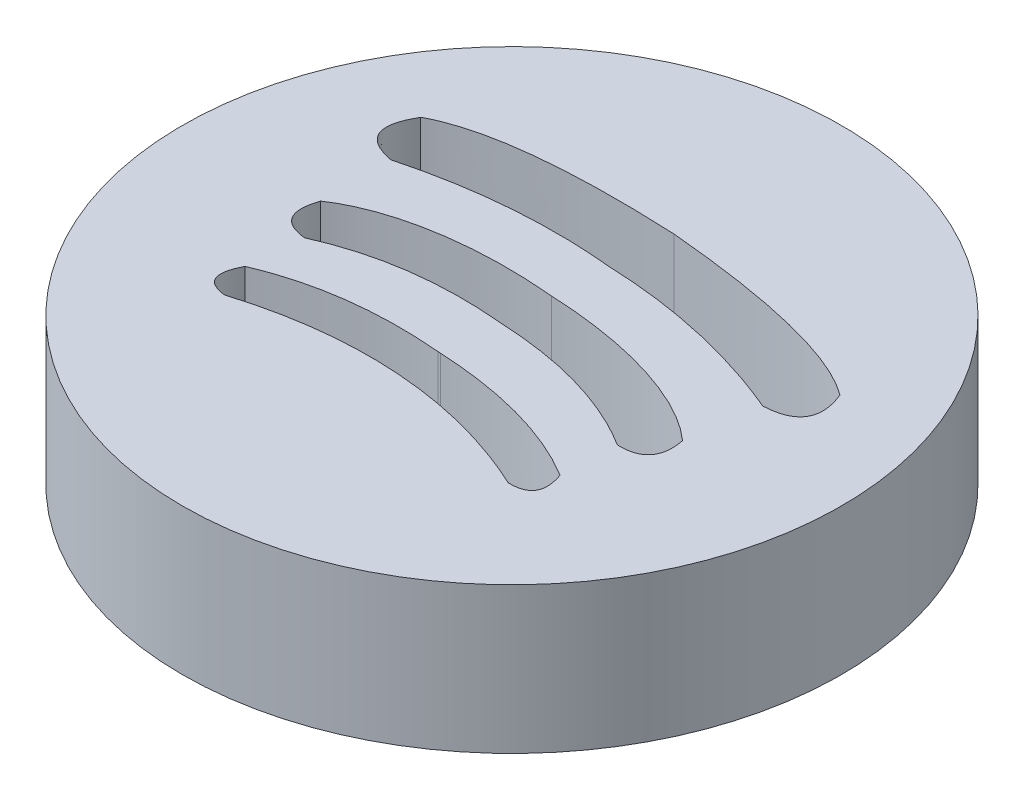
ISO-10303-21;
HEADER;
FILE_DESCRIPTION(('STEP AP214'),'2;1');
FILE_NAME('part.step','',(''),(''),'','','');
FILE_SCHEMA(('AUTOMOTIVE_DESIGN { 1 0 10303 214 1 1 1 1 }'));
ENDSEC;
DATA;
#1=APPLICATION_CONTEXT('core data for automotive mechanical design processes');
#2=APPLICATION_PROTOCOL_DEFINITION('international standard','automotive_design',2000,#1);
#3=PRODUCT_CONTEXT('',#1,'mechanical');
#4=PRODUCT('Part','Part','',(#3));
#5=PRODUCT_RELATED_PRODUCT_CATEGORY('part','',(#4));
#6=PRODUCT_DEFINITION_FORMATION('','',#4);
#7=PRODUCT_DEFINITION_CONTEXT('part definition',#1,'design');
#8=PRODUCT_DEFINITION('design','',#6,#7);
#9=PRODUCT_DEFINITION_SHAPE('','',#8);
#10=(LENGTH_UNIT() NAMED_UNIT(*) SI_UNIT(.MILLI.,.METRE.));
#11=(NAMED_UNIT(*) PLANE_ANGLE_UNIT() SI_UNIT($,.RADIAN.));
#12=(NAMED_UNIT(*) SI_UNIT($,.STERADIAN.) SOLID_ANGLE_UNIT());
#13=UNCERTAINTY_MEASURE_WITH_UNIT(LENGTH_MEASURE(1.E-05),#10,'distance_accuracy_value','');
#14=(GEOMETRIC_REPRESENTATION_CONTEXT(3) GLOBAL_UNCERTAINTY_ASSIGNED_CONTEXT((#13)) GLOBAL_UNIT_ASSIGNED_CONTEXT((#10,
#11,#12)) REPRESENTATION_CONTEXT('',''));
#15=CARTESIAN_POINT('',(0.,0.,0.));
#16=DIRECTION('',(0.,0.,1.));
#17=DIRECTION('',(1.,0.,0.));
#18=AXIS2_PLACEMENT_3D('',#15,#16,#17);
#19=CARTESIAN_POINT('',(4.84725779247813,2.,-4.63541451285348));
#20=DIRECTION('',(0.,1.,0.));
#21=DIRECTION('',(0.,0.,1.));
#22=AXIS2_PLACEMENT_3D('',#19,#20,#21);
#23=PLANE('',#22);
#24=CARTESIAN_POINT('',(4.84725779247813,2.,-4.63541451285348));
#25=DIRECTION('',(0.,1.,0.));
#26=DIRECTION('',(0.,0.,1.));
#27=AXIS2_PLACEMENT_3D('',#24,#25,#26);
#28=CIRCLE('',#27,4.51083216624037);
#29=CARTESIAN_POINT('',(4.84725779247813,2.,-0.124582346613107));
#30=VERTEX_POINT('',#29);
#31=EDGE_CURVE('E11',#30,#30,#28,.T.);
#32=ORIENTED_EDGE('',*,*,#31,.T.);
#33=EDGE_LOOP('',(#32));
#34=FACE_BOUND('',#33,.T.);
#35=CARTESIAN_POINT('',(4.98940546980019,2.,-6.7126165823093));
#36=CARTESIAN_POINT('',(2.70847393254779,2.,-6.81932821464787));
#37=CARTESIAN_POINT('',(1.87003943403578,2.,-6.3624125413338));
#38=B_SPLINE_CURVE_WITH_KNOTS('',2,(#35,#36,#37),.UNSPECIFIED.,.F.,.F.,(3,3),(0.,1.),.UNSPECIFIED.);
#39=CARTESIAN_POINT('',(4.98940546980019,2.,-6.7126165823093));
#40=VERTEX_POINT('',#39);
#41=CARTESIAN_POINT('',(1.87003943403578,2.,-6.3624125413338));
#42=VERTEX_POINT('',#41);
#43=EDGE_CURVE('E316',#40,#42,#38,.T.);
#44=ORIENTED_EDGE('',*,*,#43,.F.);
#45=CARTESIAN_POINT('',(8.03198473306715,2.,-5.94073656434407));
#46=CARTESIAN_POINT('',(7.26361044764534,2.,-6.50760982911996));
#47=CARTESIAN_POINT('',(4.98940546980019,2.,-6.7126165823093));
#48=B_SPLINE_CURVE_WITH_KNOTS('',2,(#45,#46,#47),.UNSPECIFIED.,.F.,.F.,(3,3),(0.,1.),.UNSPECIFIED.);
#49=CARTESIAN_POINT('',(8.03198473306715,2.,-5.94073656434407));
#50=VERTEX_POINT('',#49);
#51=EDGE_CURVE('E311',#50,#40,#48,.T.);
#52=ORIENTED_EDGE('',*,*,#51,.F.);
#53=CARTESIAN_POINT('',(7.63590095297284,2.,-5.28073428955623));
#54=CARTESIAN_POINT('',(8.28916295083527,2.,-5.3130360702294));
#55=CARTESIAN_POINT('',(8.03198473306715,2.,-5.94073656434407));
#56=B_SPLINE_CURVE_WITH_KNOTS('',2,(#53,#54,#55),.UNSPECIFIED.,.F.,.F.,(3,3),(0.,1.),.UNSPECIFIED.);
#57=CARTESIAN_POINT('',(7.63590095297284,2.,-5.28073428955623));
#58=VERTEX_POINT('',#57);
#59=EDGE_CURVE('E442',#58,#50,#56,.T.);
#60=ORIENTED_EDGE('',*,*,#59,.F.);
#61=CARTESIAN_POINT('',(4.93259630959555,2.,-5.88246509925867));
#62=CARTESIAN_POINT('',(6.33169602290301,2.,-5.83002968698095));
#63=CARTESIAN_POINT('',(7.63590095297284,2.,-5.28073428955623));
#64=B_SPLINE_CURVE_WITH_KNOTS('',2,(#61,#62,#63),.UNSPECIFIED.,.F.,.F.,(3,3),(0.,1.),.UNSPECIFIED.);
#65=CARTESIAN_POINT('',(4.93259630959555,2.,-5.88246509925867));
#66=VERTEX_POINT('',#65);
#67=EDGE_CURVE('E448',#66,#58,#64,.T.);
#68=ORIENTED_EDGE('',*,*,#67,.F.);
#69=CARTESIAN_POINT('',(2.17252092561603,2.,-5.65460585103602));
#70=CARTESIAN_POINT('',(3.53939632227504,2.,-6.02111312689651));
#71=CARTESIAN_POINT('',(4.93259630959555,2.,-5.88246509925867));
#72=B_SPLINE_CURVE_WITH_KNOTS('',2,(#69,#70,#71),.UNSPECIFIED.,.F.,.F.,(3,3),(0.,1.),.UNSPECIFIED.);
#73=CARTESIAN_POINT('',(2.17252092561603,2.,-5.65460585103602));
#74=VERTEX_POINT('',#73);
#75=EDGE_CURVE('E524',#74,#66,#72,.T.);
#76=ORIENTED_EDGE('',*,*,#75,.F.);
#77=CARTESIAN_POINT('',(1.87003943403578,2.,-6.3624125413338));
#78=CARTESIAN_POINT('',(1.52974919326217,2.,-5.77559817712616));
#79=CARTESIAN_POINT('',(2.17252092561603,2.,-5.65460585103602));
#80=B_SPLINE_CURVE_WITH_KNOTS('',2,(#77,#78,#79),.UNSPECIFIED.,.F.,.F.,(3,3),(0.,1.),.UNSPECIFIED.);
#81=EDGE_CURVE('E523',#42,#74,#80,.T.);
#82=ORIENTED_EDGE('',*,*,#81,.F.);
#83=EDGE_LOOP('',(#44,#52,#60,#68,#76,#82));
#84=FACE_BOUND('',#83,.T.);
#85=CARTESIAN_POINT('',(4.88179042083362,2.,-5.14003933990051));
#86=CARTESIAN_POINT('',(3.62730607239337,2.,-5.25627963586896));
#87=CARTESIAN_POINT('',(2.68965651797037,2.,-5.0306545584499));
#88=CARTESIAN_POINT('',(2.18009286438089,2.,-4.68551879994203));
#89=B_SPLINE_CURVE_WITH_KNOTS('',3,(#85,#86,#87,#88),.UNSPECIFIED.,.F.,.F.,(4,4),(0.,1.),.UNSPECIFIED.);
#90=CARTESIAN_POINT('',(4.88179042083362,2.,-5.14003933990051));
#91=VERTEX_POINT('',#90);
#92=CARTESIAN_POINT('',(2.18009286438089,2.,-4.68551879994203));
#93=VERTEX_POINT('',#92);
#94=EDGE_CURVE('E418',#91,#93,#89,.T.);
#95=ORIENTED_EDGE('',*,*,#94,.F.);
#96=CARTESIAN_POINT('',(7.4963841511337,2.,-4.32171285660529));
#97=CARTESIAN_POINT('',(7.03858747883807,2.,-4.73304728951276));
#98=CARTESIAN_POINT('',(6.14041511433174,2.,-5.08430184977799));
#99=CARTESIAN_POINT('',(4.88179042083362,2.,-5.14003933990051));
#100=B_SPLINE_CURVE_WITH_KNOTS('',3,(#96,#97,#98,#99),.UNSPECIFIED.,.F.,.F.,(4,4),(0.,1.),.UNSPECIFIED.);
#101=CARTESIAN_POINT('',(7.4963841511337,2.,-4.32171285660529));
#102=VERTEX_POINT('',#101);
#103=EDGE_CURVE('E291',#102,#91,#100,.T.);
#104=ORIENTED_EDGE('',*,*,#103,.F.);
#105=CARTESIAN_POINT('',(7.10196280452291,2.,-3.82417094775993));
#106=CARTESIAN_POINT('',(7.596066746737,2.,-3.80965362464692));
#107=CARTESIAN_POINT('',(7.4963841511337,2.,-4.32171285660529));
#108=B_SPLINE_CURVE_WITH_KNOTS('',2,(#105,#106,#107),.UNSPECIFIED.,.F.,.F.,(3,3),(0.,1.),.UNSPECIFIED.);
#109=CARTESIAN_POINT('',(7.10196280452291,2.,-3.82417094775993));
#110=VERTEX_POINT('',#109);
#111=EDGE_CURVE('E230',#110,#102,#108,.T.);
#112=ORIENTED_EDGE('',*,*,#111,.F.);
#113=CARTESIAN_POINT('',(4.83922212443066,2.,-4.4730324025778));
#114=CARTESIAN_POINT('',(6.15790572347401,2.,-4.41569467157149));
#115=CARTESIAN_POINT('',(7.10196280452291,2.,-3.82417094775993));
#116=B_SPLINE_CURVE_WITH_KNOTS('',2,(#113,#114,#115),.UNSPECIFIED.,.F.,.F.,(3,3),(0.,1.),.UNSPECIFIED.);
#117=CARTESIAN_POINT('',(4.83922212443066,2.,-4.4730324025778));
#118=VERTEX_POINT('',#117);
#119=EDGE_CURVE('E236',#118,#110,#116,.T.);
#120=ORIENTED_EDGE('',*,*,#119,.F.);
#121=DIRECTION('',(0.997666703296272,0.,0.0682726089581153));
#122=VECTOR('',#121,1.);
#123=CARTESIAN_POINT('',(4.8330977840206,2.,-4.47345150516643));
#124=LINE('',#123,#122);
#125=CARTESIAN_POINT('',(4.8330977840206,2.,-4.47345150516643));
#126=VERTEX_POINT('',#125);
#127=EDGE_CURVE('E771',#126,#118,#124,.T.);
#128=ORIENTED_EDGE('',*,*,#127,.F.);
#129=CARTESIAN_POINT('',(2.50305884629386,2.,-4.13888443928882));
#130=CARTESIAN_POINT('',(3.51889642166361,2.,-4.59628809972166));
#131=CARTESIAN_POINT('',(4.8330977840206,2.,-4.47345150516643));
#132=B_SPLINE_CURVE_WITH_KNOTS('',2,(#129,#130,#131),.UNSPECIFIED.,.F.,.F.,(3,3),(0.,1.),.UNSPECIFIED.);
#133=CARTESIAN_POINT('',(2.50305884629386,2.,-4.13888443928882));
#134=VERTEX_POINT('',#133);
#135=EDGE_CURVE('E773',#134,#126,#132,.T.);
#136=ORIENTED_EDGE('',*,*,#135,.F.);
#137=CARTESIAN_POINT('',(2.18009286438089,2.,-4.68551879994203));
#138=CARTESIAN_POINT('',(2.01158344258292,2.,-4.19181255968846));
#139=CARTESIAN_POINT('',(2.50305884629386,2.,-4.13888443928882));
#140=B_SPLINE_CURVE_WITH_KNOTS('',2,(#137,#138,#139),.UNSPECIFIED.,.F.,.F.,(3,3),(0.,1.),.UNSPECIFIED.);
#141=EDGE_CURVE('E774',#93,#134,#140,.T.);
#142=ORIENTED_EDGE('',*,*,#141,.F.);
#143=EDGE_LOOP('',(#95,#104,#112,#120,#128,#136,#142));
#144=FACE_BOUND('',#143,.T.);
#145=CARTESIAN_POINT('',(2.43553461977165,2.,-3.39217956801337));
#146=CARTESIAN_POINT('',(2.21176454515322,2.,-2.95962393907315));
#147=CARTESIAN_POINT('',(2.63517240421462,2.,-2.91425881131657));
#148=B_SPLINE_CURVE_WITH_KNOTS('',2,(#145,#146,#147),.UNSPECIFIED.,.F.,.F.,(3,3),(0.,1.),.UNSPECIFIED.);
#149=CARTESIAN_POINT('',(2.43553461977165,2.,-3.39217956801337));
#150=VERTEX_POINT('',#149);
#151=CARTESIAN_POINT('',(2.63517240421462,2.,-2.91425881131657));
#152=VERTEX_POINT('',#151);
#153=EDGE_CURVE('E184',#150,#152,#148,.T.);
#154=ORIENTED_EDGE('',*,*,#153,.F.);
#155=CARTESIAN_POINT('',(4.76583999310397,2.,-3.70415294578224));
#156=CARTESIAN_POINT('',(3.42982471425161,2.,-3.82067361564292));
#157=CARTESIAN_POINT('',(2.43553461977165,2.,-3.39217956801337));
#158=B_SPLINE_CURVE_WITH_KNOTS('',2,(#155,#156,#157),.UNSPECIFIED.,.F.,.F.,(3,3),(0.,1.),.UNSPECIFIED.);
#159=CARTESIAN_POINT('',(4.76583999310397,2.,-3.70415294578224));
#160=VERTEX_POINT('',#159);
#161=EDGE_CURVE('E176',#160,#150,#158,.T.);
#162=ORIENTED_EDGE('',*,*,#161,.F.);
#163=DIRECTION('',(-0.997666703296267,0.,-0.0682726089581976));
#164=VECTOR('',#163,1.);
#165=CARTESIAN_POINT('',(4.76583999310397,2.,-3.70415294578224));
#166=LINE('',#165,#164);
#167=CARTESIAN_POINT('',(4.80105397763659,2.,-3.70174317247026));
#168=VERTEX_POINT('',#167);
#169=EDGE_CURVE('E359',#168,#160,#166,.T.);
#170=ORIENTED_EDGE('',*,*,#169,.F.);
#171=CARTESIAN_POINT('',(7.06713647124811,2.,-3.0752284850403));
#172=CARTESIAN_POINT('',(6.14048774028241,2.,-3.63517675964662));
#173=CARTESIAN_POINT('',(4.8010539776366,2.,-3.70174317247026));
#174=B_SPLINE_CURVE_WITH_KNOTS('',2,(#171,#172,#173),.UNSPECIFIED.,.F.,.F.,(3,3),(0.,1.),.UNSPECIFIED.);
#175=CARTESIAN_POINT('',(7.06713647124811,2.,-3.0752284850403));
#176=VERTEX_POINT('',#175);
#177=EDGE_CURVE('E728',#176,#168,#174,.T.);
#178=ORIENTED_EDGE('',*,*,#177,.F.);
#179=CARTESIAN_POINT('',(6.80425424170266,2.,-2.62895902826766));
#180=CARTESIAN_POINT('',(7.22989490431553,2.,-2.61622182834778));
#181=CARTESIAN_POINT('',(7.06713647124811,2.,-3.0752284850403));
#182=B_SPLINE_CURVE_WITH_KNOTS('',2,(#179,#180,#181),.UNSPECIFIED.,.F.,.F.,(3,3),(0.,1.),.UNSPECIFIED.);
#183=CARTESIAN_POINT('',(6.80425424170266,2.,-2.62895902826766));
#184=VERTEX_POINT('',#183);
#185=EDGE_CURVE('E732',#184,#176,#182,.T.);
#186=ORIENTED_EDGE('',*,*,#185,.F.);
#187=CARTESIAN_POINT('',(4.77441326033121,2.,-3.16339640780165));
#188=CARTESIAN_POINT('',(5.80955430026965,2.,-3.09103181208245));
#189=CARTESIAN_POINT('',(6.80425424170266,2.,-2.62895902826766));
#190=B_SPLINE_CURVE_WITH_KNOTS('',2,(#187,#188,#189),.UNSPECIFIED.,.F.,.F.,(3,3),(0.,1.),.UNSPECIFIED.);
#191=CARTESIAN_POINT('',(4.77441326033121,2.,-3.16339640780165));
#192=VERTEX_POINT('',#191);
#193=EDGE_CURVE('E740',#192,#184,#190,.T.);
#194=ORIENTED_EDGE('',*,*,#193,.F.);
#195=DIRECTION('',(0.997666703296266,0.,0.0682726089582034));
#196=VECTOR('',#195,1.);
#197=CARTESIAN_POINT('',(4.7188951989524,2.,-3.16719563542157));
#198=LINE('',#197,#196);
#199=CARTESIAN_POINT('',(4.7188951989524,2.,-3.16719563542157));
#200=VERTEX_POINT('',#199);
#201=EDGE_CURVE('E199',#200,#192,#198,.T.);
#202=ORIENTED_EDGE('',*,*,#201,.F.);
#203=CARTESIAN_POINT('',(2.63517240421462,2.,-2.91425881131657));
#204=CARTESIAN_POINT('',(3.68354606844259,2.,-3.23651940646029));
#205=CARTESIAN_POINT('',(4.7188951989524,2.,-3.16719563542157));
#206=B_SPLINE_CURVE_WITH_KNOTS('',2,(#203,#204,#205),.UNSPECIFIED.,.F.,.F.,(3,3),(0.,1.),.UNSPECIFIED.);
#207=EDGE_CURVE('E197',#152,#200,#206,.T.);
#208=ORIENTED_EDGE('',*,*,#207,.F.);
#209=EDGE_LOOP('',(#154,#162,#170,#178,#186,#194,#202,#208));
#210=FACE_BOUND('',#209,.T.);
#211=ADVANCED_FACE('F33',(#34,#84,#144,#210),#23,.T.);
#212=CARTESIAN_POINT('',(4.84725779247813,0.,-4.63541451285348));
#213=DIRECTION('',(0.,1.,0.));
#214=DIRECTION('',(0.,0.,1.));
#215=AXIS2_PLACEMENT_3D('',#212,#213,#214);
#216=PLANE('',#215);
#217=CARTESIAN_POINT('',(7.4963841511337,0.,-4.32171285660529));
#218=CARTESIAN_POINT('',(7.03858747883807,0.,-4.73304728951276));
#219=CARTESIAN_POINT('',(6.14041511433174,0.,-5.08430184977799));
#220=CARTESIAN_POINT('',(4.88179042083362,0.,-5.14003933990051));
#221=B_SPLINE_CURVE_WITH_KNOTS('',3,(#217,#218,#219,#220),.UNSPECIFIED.,.F.,.F.,(4,4),(0.,1.),.UNSPECIFIED.);
#222=CARTESIAN_POINT('',(7.4963841511337,0.,-4.32171285660529));
#223=VERTEX_POINT('',#222);
#224=CARTESIAN_POINT('',(4.88179042083362,0.,-5.14003933990051));
#225=VERTEX_POINT('',#224);
#226=EDGE_CURVE('E192',#223,#225,#221,.T.);
#227=ORIENTED_EDGE('',*,*,#226,.T.);
#228=CARTESIAN_POINT('',(4.88179042083362,0.,-5.14003933990051));
#229=CARTESIAN_POINT('',(3.62730607239337,0.,-5.25627963586896));
#230=CARTESIAN_POINT('',(2.68965651797037,0.,-5.0306545584499));
#231=CARTESIAN_POINT('',(2.18009286438089,0.,-4.68551879994203));
#232=B_SPLINE_CURVE_WITH_KNOTS('',3,(#228,#229,#230,#231),.UNSPECIFIED.,.F.,.F.,(4,4),(0.,1.),.UNSPECIFIED.);
#233=CARTESIAN_POINT('',(2.18009286438089,0.,-4.68551879994203));
#234=VERTEX_POINT('',#233);
#235=EDGE_CURVE('E248',#225,#234,#232,.T.);
#236=ORIENTED_EDGE('',*,*,#235,.T.);
#237=CARTESIAN_POINT('',(2.18009286438089,0.,-4.68551879994203));
#238=CARTESIAN_POINT('',(2.01158344258292,0.,-4.19181255968846));
#239=CARTESIAN_POINT('',(2.50305884629386,0.,-4.13888443928882));
#240=B_SPLINE_CURVE_WITH_KNOTS('',2,(#237,#238,#239),.UNSPECIFIED.,.F.,.F.,(3,3),(0.,1.),.UNSPECIFIED.);
#241=CARTESIAN_POINT('',(2.50305884629386,0.,-4.13888443928882));
#242=VERTEX_POINT('',#241);
#243=EDGE_CURVE('E256',#234,#242,#240,.T.);
#244=ORIENTED_EDGE('',*,*,#243,.T.);
#245=CARTESIAN_POINT('',(2.50305884629386,0.,-4.13888443928882));
#246=CARTESIAN_POINT('',(3.51889642166361,0.,-4.59628809972166));
#247=CARTESIAN_POINT('',(4.8330977840206,0.,-4.47345150516643));
#248=B_SPLINE_CURVE_WITH_KNOTS('',2,(#245,#246,#247),.UNSPECIFIED.,.F.,.F.,(3,3),(0.,1.),.UNSPECIFIED.);
#249=CARTESIAN_POINT('',(4.8330977840206,0.,-4.47345150516643));
#250=VERTEX_POINT('',#249);
#251=EDGE_CURVE('E264',#242,#250,#248,.T.);
#252=ORIENTED_EDGE('',*,*,#251,.T.);
#253=DIRECTION('',(0.997666703296272,0.,0.0682726089581153));
#254=VECTOR('',#253,1.);
#255=CARTESIAN_POINT('',(4.8330977840206,0.,-4.47345150516643));
#256=LINE('',#255,#254);
#257=CARTESIAN_POINT('',(4.83922212443066,0.,-4.4730324025778));
#258=VERTEX_POINT('',#257);
#259=EDGE_CURVE('E272',#250,#258,#256,.T.);
#260=ORIENTED_EDGE('',*,*,#259,.T.);
#261=CARTESIAN_POINT('',(4.83922212443066,0.,-4.4730324025778));
#262=CARTESIAN_POINT('',(6.15790572347401,0.,-4.41569467157149));
#263=CARTESIAN_POINT('',(7.10196280452291,0.,-3.82417094775993));
#264=B_SPLINE_CURVE_WITH_KNOTS('',2,(#261,#262,#263),.UNSPECIFIED.,.F.,.F.,(3,3),(0.,1.),.UNSPECIFIED.);
#265=CARTESIAN_POINT('',(7.10196280452291,0.,-3.82417094775993));
#266=VERTEX_POINT('',#265);
#267=EDGE_CURVE('E278',#258,#266,#264,.T.);
#268=ORIENTED_EDGE('',*,*,#267,.T.);
#269=CARTESIAN_POINT('',(7.10196280452291,0.,-3.82417094775993));
#270=CARTESIAN_POINT('',(7.596066746737,0.,-3.80965362464692));
#271=CARTESIAN_POINT('',(7.4963841511337,0.,-4.32171285660529));
#272=B_SPLINE_CURVE_WITH_KNOTS('',2,(#269,#270,#271),.UNSPECIFIED.,.F.,.F.,(3,3),(0.,1.),.UNSPECIFIED.);
#273=EDGE_CURVE('E283',#266,#223,#272,.T.);
#274=ORIENTED_EDGE('',*,*,#273,.T.);
#275=EDGE_LOOP('',(#227,#236,#244,#252,#260,#268,#274));
#276=FACE_BOUND('',#275,.T.);
#277=CARTESIAN_POINT('',(4.84725779247813,0.,-4.63541451285348));
#278=DIRECTION('',(0.,1.,0.));
#279=DIRECTION('',(0.,0.,1.));
#280=AXIS2_PLACEMENT_3D('',#277,#278,#279);
#281=CIRCLE('',#280,4.51083216624037);
#282=CARTESIAN_POINT('',(4.84725779247813,0.,-0.124582346613107));
#283=VERTEX_POINT('',#282);
#284=EDGE_CURVE('E37',#283,#283,#281,.T.);
#285=ORIENTED_EDGE('',*,*,#284,.F.);
#286=EDGE_LOOP('',(#285));
#287=FACE_BOUND('',#286,.T.);
#288=CARTESIAN_POINT('',(8.03198473306715,0.,-5.94073656434407));
#289=CARTESIAN_POINT('',(7.26361044764534,0.,-6.50760982911996));
#290=CARTESIAN_POINT('',(4.98940546980019,0.,-6.7126165823093));
#291=B_SPLINE_CURVE_WITH_KNOTS('',2,(#288,#289,#290),.UNSPECIFIED.,.F.,.F.,(3,3),(0.,1.),.UNSPECIFIED.);
#292=CARTESIAN_POINT('',(8.03198473306715,0.,-5.94073656434407));
#293=VERTEX_POINT('',#292);
#294=CARTESIAN_POINT('',(4.98940546980019,0.,-6.7126165823093));
#295=VERTEX_POINT('',#294);
#296=EDGE_CURVE('E310',#293,#295,#291,.T.);
#297=ORIENTED_EDGE('',*,*,#296,.T.);
#298=CARTESIAN_POINT('',(4.98940546980019,0.,-6.7126165823093));
#299=CARTESIAN_POINT('',(2.70847393254779,0.,-6.81932821464787));
#300=CARTESIAN_POINT('',(1.87003943403578,0.,-6.3624125413338));
#301=B_SPLINE_CURVE_WITH_KNOTS('',2,(#298,#299,#300),.UNSPECIFIED.,.F.,.F.,(3,3),(0.,1.),.UNSPECIFIED.);
#302=CARTESIAN_POINT('',(1.87003943403578,0.,-6.3624125413338));
#303=VERTEX_POINT('',#302);
#304=EDGE_CURVE('E459',#295,#303,#301,.T.);
#305=ORIENTED_EDGE('',*,*,#304,.T.);
#306=CARTESIAN_POINT('',(1.87003943403578,0.,-6.3624125413338));
#307=CARTESIAN_POINT('',(1.52974919326217,0.,-5.77559817712616));
#308=CARTESIAN_POINT('',(2.17252092561603,0.,-5.65460585103602));
#309=B_SPLINE_CURVE_WITH_KNOTS('',2,(#306,#307,#308),.UNSPECIFIED.,.F.,.F.,(3,3),(0.,1.),.UNSPECIFIED.);
#310=CARTESIAN_POINT('',(2.17252092561603,0.,-5.65460585103602));
#311=VERTEX_POINT('',#310);
#312=EDGE_CURVE('E466',#303,#311,#309,.T.);
#313=ORIENTED_EDGE('',*,*,#312,.T.);
#314=CARTESIAN_POINT('',(2.17252092561603,0.,-5.65460585103602));
#315=CARTESIAN_POINT('',(3.53939632227504,0.,-6.02111312689651));
#316=CARTESIAN_POINT('',(4.93259630959555,0.,-5.88246509925867));
#317=B_SPLINE_CURVE_WITH_KNOTS('',2,(#314,#315,#316),.UNSPECIFIED.,.F.,.F.,(3,3),(0.,1.),.UNSPECIFIED.);
#318=CARTESIAN_POINT('',(4.93259630959555,0.,-5.88246509925867));
#319=VERTEX_POINT('',#318);
#320=EDGE_CURVE('E474',#311,#319,#317,.T.);
#321=ORIENTED_EDGE('',*,*,#320,.T.);
#322=CARTESIAN_POINT('',(4.93259630959555,0.,-5.88246509925867));
#323=CARTESIAN_POINT('',(6.33169602290301,0.,-5.83002968698095));
#324=CARTESIAN_POINT('',(7.63590095297284,0.,-5.28073428955623));
#325=B_SPLINE_CURVE_WITH_KNOTS('',2,(#322,#323,#324),.UNSPECIFIED.,.F.,.F.,(3,3),(0.,1.),.UNSPECIFIED.);
#326=CARTESIAN_POINT('',(7.63590095297284,0.,-5.28073428955623));
#327=VERTEX_POINT('',#326);
#328=EDGE_CURVE('E482',#319,#327,#325,.T.);
#329=ORIENTED_EDGE('',*,*,#328,.T.);
#330=CARTESIAN_POINT('',(7.63590095297284,0.,-5.28073428955623));
#331=CARTESIAN_POINT('',(8.28916295083527,0.,-5.3130360702294));
#332=CARTESIAN_POINT('',(8.03198473306715,0.,-5.94073656434407));
#333=B_SPLINE_CURVE_WITH_KNOTS('',2,(#330,#331,#332),.UNSPECIFIED.,.F.,.F.,(3,3),(0.,1.),.UNSPECIFIED.);
#334=EDGE_CURVE('E317',#327,#293,#333,.T.);
#335=ORIENTED_EDGE('',*,*,#334,.T.);
#336=EDGE_LOOP('',(#297,#305,#313,#321,#329,#335));
#337=FACE_BOUND('',#336,.T.);
#338=CARTESIAN_POINT('',(4.76583999310397,0.,-3.70415294578224));
#339=CARTESIAN_POINT('',(3.42982471425161,0.,-3.82067361564292));
#340=CARTESIAN_POINT('',(2.43553461977165,0.,-3.39217956801337));
#341=B_SPLINE_CURVE_WITH_KNOTS('',2,(#338,#339,#340),.UNSPECIFIED.,.F.,.F.,(3,3),(0.,1.),.UNSPECIFIED.);
#342=CARTESIAN_POINT('',(4.76583999310397,0.,-3.70415294578224));
#343=VERTEX_POINT('',#342);
#344=CARTESIAN_POINT('',(2.43553461977165,0.,-3.39217956801337));
#345=VERTEX_POINT('',#344);
#346=EDGE_CURVE('E56',#343,#345,#341,.T.);
#347=ORIENTED_EDGE('',*,*,#346,.T.);
#348=CARTESIAN_POINT('',(2.43553461977165,0.,-3.39217956801337));
#349=CARTESIAN_POINT('',(2.21176454515322,0.,-2.95962393907315));
#350=CARTESIAN_POINT('',(2.63517240421462,0.,-2.91425881131657));
#351=B_SPLINE_CURVE_WITH_KNOTS('',2,(#348,#349,#350),.UNSPECIFIED.,.F.,.F.,(3,3),(0.,1.),.UNSPECIFIED.);
#352=CARTESIAN_POINT('',(2.63517240421462,0.,-2.91425881131657));
#353=VERTEX_POINT('',#352);
#354=EDGE_CURVE('E191',#345,#353,#351,.T.);
#355=ORIENTED_EDGE('',*,*,#354,.T.);
#356=CARTESIAN_POINT('',(2.63517240421462,0.,-2.91425881131657));
#357=CARTESIAN_POINT('',(3.68354606844259,0.,-3.23651940646029));
#358=CARTESIAN_POINT('',(4.7188951989524,0.,-3.16719563542157));
#359=B_SPLINE_CURVE_WITH_KNOTS('',2,(#356,#357,#358),.UNSPECIFIED.,.F.,.F.,(3,3),(0.,1.),.UNSPECIFIED.);
#360=CARTESIAN_POINT('',(4.7188951989524,0.,-3.16719563542157));
#361=VERTEX_POINT('',#360);
#362=EDGE_CURVE('E354',#353,#361,#359,.T.);
#363=ORIENTED_EDGE('',*,*,#362,.T.);
#364=DIRECTION('',(0.997666703296266,0.,0.0682726089582034));
#365=VECTOR('',#364,1.);
#366=CARTESIAN_POINT('',(4.7188951989524,0.,-3.16719563542157));
#367=LINE('',#366,#365);
#368=CARTESIAN_POINT('',(4.77441326033121,0.,-3.16339640780165));
#369=VERTEX_POINT('',#368);
#370=EDGE_CURVE('E373',#361,#369,#367,.T.);
#371=ORIENTED_EDGE('',*,*,#370,.T.);
#372=CARTESIAN_POINT('',(4.77441326033121,0.,-3.16339640780165));
#373=CARTESIAN_POINT('',(5.80955430026965,0.,-3.09103181208245));
#374=CARTESIAN_POINT('',(6.80425424170266,0.,-2.62895902826766));
#375=B_SPLINE_CURVE_WITH_KNOTS('',2,(#372,#373,#374),.UNSPECIFIED.,.F.,.F.,(3,3),(0.,1.),.UNSPECIFIED.);
#376=CARTESIAN_POINT('',(6.80425424170266,0.,-2.62895902826766));
#377=VERTEX_POINT('',#376);
#378=EDGE_CURVE('E379',#369,#377,#375,.T.);
#379=ORIENTED_EDGE('',*,*,#378,.T.);
#380=CARTESIAN_POINT('',(6.80425424170266,0.,-2.62895902826766));
#381=CARTESIAN_POINT('',(7.22989490431553,0.,-2.61622182834778));
#382=CARTESIAN_POINT('',(7.06713647124811,0.,-3.0752284850403));
#383=B_SPLINE_CURVE_WITH_KNOTS('',2,(#380,#381,#382),.UNSPECIFIED.,.F.,.F.,(3,3),(0.,1.),.UNSPECIFIED.);
#384=CARTESIAN_POINT('',(7.06713647124811,0.,-3.0752284850403));
#385=VERTEX_POINT('',#384);
#386=EDGE_CURVE('E384',#377,#385,#383,.T.);
#387=ORIENTED_EDGE('',*,*,#386,.T.);
#388=CARTESIAN_POINT('',(7.06713647124811,0.,-3.0752284850403));
#389=CARTESIAN_POINT('',(6.14048774028241,0.,-3.63517675964662));
#390=CARTESIAN_POINT('',(4.8010539776366,0.,-3.70174317247026));
#391=B_SPLINE_CURVE_WITH_KNOTS('',2,(#388,#389,#390),.UNSPECIFIED.,.F.,.F.,(3,3),(0.,1.),.UNSPECIFIED.);
#392=CARTESIAN_POINT('',(4.80105397763659,0.,-3.70174317247026));
#393=VERTEX_POINT('',#392);
#394=EDGE_CURVE('E392',#385,#393,#391,.T.);
#395=ORIENTED_EDGE('',*,*,#394,.T.);
#396=DIRECTION('',(-0.997666703296267,0.,-0.0682726089581976));
#397=VECTOR('',#396,1.);
#398=CARTESIAN_POINT('',(4.76583999310397,0.,-3.70415294578224));
#399=LINE('',#398,#397);
#400=EDGE_CURVE('E185',#393,#343,#399,.T.);
#401=ORIENTED_EDGE('',*,*,#400,.T.);
#402=EDGE_LOOP('',(#347,#355,#363,#371,#379,#387,#395,#401));
#403=FACE_BOUND('',#402,.T.);
#404=ADVANCED_FACE('F334',(#276,#287,#337,#403),#216,.F.);
#405=CARTESIAN_POINT('',(4.84725779247813,2.,-4.63541451285348));
#406=DIRECTION('',(0.,-1.,0.));
#407=DIRECTION('',(0.,0.,-1.));
#408=AXIS2_PLACEMENT_3D('',#405,#406,#407);
#409=CYLINDRICAL_SURFACE('',#408,4.51083216624037);
#410=ORIENTED_EDGE('',*,*,#31,.F.);
#411=EDGE_LOOP('',(#410));
#412=FACE_BOUND('',#411,.T.);
#413=ORIENTED_EDGE('',*,*,#284,.T.);
#414=EDGE_LOOP('',(#413));
#415=FACE_BOUND('',#414,.T.);
#416=ADVANCED_FACE('F35',(#412,#415),#409,.T.);
#417=DIRECTION('',(0.,-1.,0.));
#418=VECTOR('',#417,1.);
#419=SURFACE_OF_LINEAR_EXTRUSION('',#48,#418);
#420=ORIENTED_EDGE('',*,*,#296,.F.);
#421=DIRECTION('',(0.,-1.,0.));
#422=VECTOR('',#421,1.);
#423=CARTESIAN_POINT('',(8.03198473306715,2.,-5.94073656434407));
#424=LINE('',#423,#422);
#425=EDGE_CURVE('E447',#50,#293,#424,.T.);
#426=ORIENTED_EDGE('',*,*,#425,.F.);
#427=ORIENTED_EDGE('',*,*,#51,.T.);
#428=DIRECTION('',(0.,-1.,0.));
#429=VECTOR('',#428,1.);
#430=CARTESIAN_POINT('',(4.98940546980019,2.,-6.7126165823093));
#431=LINE('',#430,#429);
#432=EDGE_CURVE('E509',#40,#295,#431,.T.);
#433=ORIENTED_EDGE('',*,*,#432,.T.);
#434=EDGE_LOOP('',(#420,#426,#427,#433));
#435=FACE_BOUND('',#434,.T.);
#436=ADVANCED_FACE('F326',(#435),#419,.T.);
#437=DIRECTION('',(0.,-1.,0.));
#438=VECTOR('',#437,1.);
#439=SURFACE_OF_LINEAR_EXTRUSION('',#38,#438);
#440=ORIENTED_EDGE('',*,*,#304,.F.);
#441=ORIENTED_EDGE('',*,*,#432,.F.);
#442=ORIENTED_EDGE('',*,*,#43,.T.);
#443=DIRECTION('',(0.,-1.,0.));
#444=VECTOR('',#443,1.);
#445=CARTESIAN_POINT('',(1.87003943403578,2.,-6.3624125413338));
#446=LINE('',#445,#444);
#447=EDGE_CURVE('E507',#42,#303,#446,.T.);
#448=ORIENTED_EDGE('',*,*,#447,.T.);
#449=EDGE_LOOP('',(#440,#441,#442,#448));
#450=FACE_BOUND('',#449,.T.);
#451=ADVANCED_FACE('F330',(#450),#439,.T.);
#452=DIRECTION('',(0.,-1.,0.));
#453=VECTOR('',#452,1.);
#454=SURFACE_OF_LINEAR_EXTRUSION('',#80,#453);
#455=ORIENTED_EDGE('',*,*,#312,.F.);
#456=ORIENTED_EDGE('',*,*,#447,.F.);
#457=ORIENTED_EDGE('',*,*,#81,.T.);
#458=DIRECTION('',(0.,-1.,0.));
#459=VECTOR('',#458,1.);
#460=CARTESIAN_POINT('',(2.17252092561603,2.,-5.65460585103602));
#461=LINE('',#460,#459);
#462=EDGE_CURVE('E505',#74,#311,#461,.T.);
#463=ORIENTED_EDGE('',*,*,#462,.T.);
#464=EDGE_LOOP('',(#455,#456,#457,#463));
#465=FACE_BOUND('',#464,.T.);
#466=ADVANCED_FACE('F536',(#465),#454,.T.);
#467=DIRECTION('',(0.,-1.,0.));
#468=VECTOR('',#467,1.);
#469=SURFACE_OF_LINEAR_EXTRUSION('',#72,#468);
#470=ORIENTED_EDGE('',*,*,#320,.F.);
#471=ORIENTED_EDGE('',*,*,#462,.F.);
#472=ORIENTED_EDGE('',*,*,#75,.T.);
#473=DIRECTION('',(0.,-1.,0.));
#474=VECTOR('',#473,1.);
#475=CARTESIAN_POINT('',(4.93259630959555,2.,-5.88246509925867));
#476=LINE('',#475,#474);
#477=EDGE_CURVE('E503',#66,#319,#476,.T.);
#478=ORIENTED_EDGE('',*,*,#477,.T.);
#479=EDGE_LOOP('',(#470,#471,#472,#478));
#480=FACE_BOUND('',#479,.T.);
#481=ADVANCED_FACE('F538',(#480),#469,.T.);
#482=DIRECTION('',(0.,-1.,0.));
#483=VECTOR('',#482,1.);
#484=SURFACE_OF_LINEAR_EXTRUSION('',#64,#483);
#485=ORIENTED_EDGE('',*,*,#328,.F.);
#486=ORIENTED_EDGE('',*,*,#477,.F.);
#487=ORIENTED_EDGE('',*,*,#67,.T.);
#488=DIRECTION('',(0.,-1.,0.));
#489=VECTOR('',#488,1.);
#490=CARTESIAN_POINT('',(7.63590095297284,2.,-5.28073428955623));
#491=LINE('',#490,#489);
#492=EDGE_CURVE('E501',#58,#327,#491,.T.);
#493=ORIENTED_EDGE('',*,*,#492,.T.);
#494=EDGE_LOOP('',(#485,#486,#487,#493));
#495=FACE_BOUND('',#494,.T.);
#496=ADVANCED_FACE('F438',(#495),#484,.T.);
#497=DIRECTION('',(0.,-1.,0.));
#498=VECTOR('',#497,1.);
#499=SURFACE_OF_LINEAR_EXTRUSION('',#56,#498);
#500=ORIENTED_EDGE('',*,*,#334,.F.);
#501=ORIENTED_EDGE('',*,*,#492,.F.);
#502=ORIENTED_EDGE('',*,*,#59,.T.);
#503=ORIENTED_EDGE('',*,*,#425,.T.);
#504=EDGE_LOOP('',(#500,#501,#502,#503));
#505=FACE_BOUND('',#504,.T.);
#506=ADVANCED_FACE('F432',(#505),#499,.T.);
#507=DIRECTION('',(0.,-1.,0.));
#508=VECTOR('',#507,1.);
#509=SURFACE_OF_LINEAR_EXTRUSION('',#100,#508);
#510=ORIENTED_EDGE('',*,*,#226,.F.);
#511=DIRECTION('',(0.,-1.,0.));
#512=VECTOR('',#511,1.);
#513=CARTESIAN_POINT('',(7.4963841511337,2.,-4.32171285660529));
#514=LINE('',#513,#512);
#515=EDGE_CURVE('E235',#102,#223,#514,.T.);
#516=ORIENTED_EDGE('',*,*,#515,.F.);
#517=ORIENTED_EDGE('',*,*,#103,.T.);
#518=DIRECTION('',(0.,-1.,0.));
#519=VECTOR('',#518,1.);
#520=CARTESIAN_POINT('',(4.88179042083362,2.,-5.14003933990051));
#521=LINE('',#520,#519);
#522=EDGE_CURVE('E307',#91,#225,#521,.T.);
#523=ORIENTED_EDGE('',*,*,#522,.T.);
#524=EDGE_LOOP('',(#510,#516,#517,#523));
#525=FACE_BOUND('',#524,.T.);
#526=ADVANCED_FACE('F427',(#525),#509,.T.);
#527=DIRECTION('',(0.,-1.,0.));
#528=VECTOR('',#527,1.);
#529=SURFACE_OF_LINEAR_EXTRUSION('',#89,#528);
#530=ORIENTED_EDGE('',*,*,#235,.F.);
#531=ORIENTED_EDGE('',*,*,#522,.F.);
#532=ORIENTED_EDGE('',*,*,#94,.T.);
#533=DIRECTION('',(0.,-1.,0.));
#534=VECTOR('',#533,1.);
#535=CARTESIAN_POINT('',(2.18009286438089,2.,-4.68551879994203));
#536=LINE('',#535,#534);
#537=EDGE_CURVE('E305',#93,#234,#536,.T.);
#538=ORIENTED_EDGE('',*,*,#537,.T.);
#539=EDGE_LOOP('',(#530,#531,#532,#538));
#540=FACE_BOUND('',#539,.T.);
#541=ADVANCED_FACE('F431',(#540),#529,.T.);
#542=DIRECTION('',(0.,-1.,0.));
#543=VECTOR('',#542,1.);
#544=SURFACE_OF_LINEAR_EXTRUSION('',#140,#543);
#545=ORIENTED_EDGE('',*,*,#243,.F.);
#546=ORIENTED_EDGE('',*,*,#537,.F.);
#547=ORIENTED_EDGE('',*,*,#141,.T.);
#548=DIRECTION('',(0.,-1.,0.));
#549=VECTOR('',#548,1.);
#550=CARTESIAN_POINT('',(2.50305884629386,2.,-4.13888443928882));
#551=LINE('',#550,#549);
#552=EDGE_CURVE('E303',#134,#242,#551,.T.);
#553=ORIENTED_EDGE('',*,*,#552,.T.);
#554=EDGE_LOOP('',(#545,#546,#547,#553));
#555=FACE_BOUND('',#554,.T.);
#556=ADVANCED_FACE('F568',(#555),#544,.T.);
#557=DIRECTION('',(0.,-1.,0.));
#558=VECTOR('',#557,1.);
#559=SURFACE_OF_LINEAR_EXTRUSION('',#132,#558);
#560=ORIENTED_EDGE('',*,*,#251,.F.);
#561=ORIENTED_EDGE('',*,*,#552,.F.);
#562=ORIENTED_EDGE('',*,*,#135,.T.);
#563=DIRECTION('',(0.,-1.,0.));
#564=VECTOR('',#563,1.);
#565=CARTESIAN_POINT('',(4.8330977840206,2.,-4.47345150516643));
#566=LINE('',#565,#564);
#567=EDGE_CURVE('E301',#126,#250,#566,.T.);
#568=ORIENTED_EDGE('',*,*,#567,.T.);
#569=EDGE_LOOP('',(#560,#561,#562,#568));
#570=FACE_BOUND('',#569,.T.);
#571=ADVANCED_FACE('F575',(#570),#559,.T.);
#572=CARTESIAN_POINT('',(4.8330977840206,2.,-4.47345150516643));
#573=DIRECTION('',(0.0682726089581153,0.,-0.997666703296272));
#574=DIRECTION('',(-0.997666703296272,0.,-0.0682726089581153));
#575=AXIS2_PLACEMENT_3D('',#572,#573,#574);
#576=PLANE('',#575);
#577=ORIENTED_EDGE('',*,*,#259,.F.);
#578=ORIENTED_EDGE('',*,*,#567,.F.);
#579=ORIENTED_EDGE('',*,*,#127,.T.);
#580=DIRECTION('',(0.,-1.,0.));
#581=VECTOR('',#580,1.);
#582=CARTESIAN_POINT('',(4.83922212443066,2.,-4.4730324025778));
#583=LINE('',#582,#581);
#584=EDGE_CURVE('E299',#118,#258,#583,.T.);
#585=ORIENTED_EDGE('',*,*,#584,.T.);
#586=EDGE_LOOP('',(#577,#578,#579,#585));
#587=FACE_BOUND('',#586,.T.);
#588=ADVANCED_FACE('F582',(#587),#576,.T.);
#589=DIRECTION('',(0.,-1.,0.));
#590=VECTOR('',#589,1.);
#591=SURFACE_OF_LINEAR_EXTRUSION('',#116,#590);
#592=ORIENTED_EDGE('',*,*,#267,.F.);
#593=ORIENTED_EDGE('',*,*,#584,.F.);
#594=ORIENTED_EDGE('',*,*,#119,.T.);
#595=DIRECTION('',(0.,-1.,0.));
#596=VECTOR('',#595,1.);
#597=CARTESIAN_POINT('',(7.10196280452291,2.,-3.82417094775993));
#598=LINE('',#597,#596);
#599=EDGE_CURVE('E297',#110,#266,#598,.T.);
#600=ORIENTED_EDGE('',*,*,#599,.T.);
#601=EDGE_LOOP('',(#592,#593,#594,#600));
#602=FACE_BOUND('',#601,.T.);
#603=ADVANCED_FACE('F226',(#602),#591,.T.);
#604=DIRECTION('',(0.,-1.,0.));
#605=VECTOR('',#604,1.);
#606=SURFACE_OF_LINEAR_EXTRUSION('',#108,#605);
#607=ORIENTED_EDGE('',*,*,#273,.F.);
#608=ORIENTED_EDGE('',*,*,#599,.F.);
#609=ORIENTED_EDGE('',*,*,#111,.T.);
#610=ORIENTED_EDGE('',*,*,#515,.T.);
#611=EDGE_LOOP('',(#607,#608,#609,#610));
#612=FACE_BOUND('',#611,.T.);
#613=ADVANCED_FACE('F222',(#612),#606,.T.);
#614=DIRECTION('',(0.,-1.,0.));
#615=VECTOR('',#614,1.);
#616=SURFACE_OF_LINEAR_EXTRUSION('',#158,#615);
#617=ORIENTED_EDGE('',*,*,#346,.F.);
#618=DIRECTION('',(0.,-1.,0.));
#619=VECTOR('',#618,1.);
#620=CARTESIAN_POINT('',(4.76583999310397,2.,-3.70415294578224));
#621=LINE('',#620,#619);
#622=EDGE_CURVE('E180',#160,#343,#621,.T.);
#623=ORIENTED_EDGE('',*,*,#622,.F.);
#624=ORIENTED_EDGE('',*,*,#161,.T.);
#625=DIRECTION('',(0.,-1.,0.));
#626=VECTOR('',#625,1.);
#627=CARTESIAN_POINT('',(2.43553461977165,2.,-3.39217956801337));
#628=LINE('',#627,#626);
#629=EDGE_CURVE('E179',#150,#345,#628,.T.);
#630=ORIENTED_EDGE('',*,*,#629,.T.);
#631=EDGE_LOOP('',(#617,#623,#624,#630));
#632=FACE_BOUND('',#631,.T.);
#633=ADVANCED_FACE('F178',(#632),#616,.T.);
#634=DIRECTION('',(0.,-1.,0.));
#635=VECTOR('',#634,1.);
#636=SURFACE_OF_LINEAR_EXTRUSION('',#148,#635);
#637=ORIENTED_EDGE('',*,*,#354,.F.);
#638=ORIENTED_EDGE('',*,*,#629,.F.);
#639=ORIENTED_EDGE('',*,*,#153,.T.);
#640=DIRECTION('',(0.,-1.,0.));
#641=VECTOR('',#640,1.);
#642=CARTESIAN_POINT('',(2.63517240421462,2.,-2.91425881131657));
#643=LINE('',#642,#641);
#644=EDGE_CURVE('E193',#152,#353,#643,.T.);
#645=ORIENTED_EDGE('',*,*,#644,.T.);
#646=EDGE_LOOP('',(#637,#638,#639,#645));
#647=FACE_BOUND('',#646,.T.);
#648=ADVANCED_FACE('F188',(#647),#636,.T.);
#649=DIRECTION('',(0.,-1.,0.));
#650=VECTOR('',#649,1.);
#651=SURFACE_OF_LINEAR_EXTRUSION('',#206,#650);
#652=ORIENTED_EDGE('',*,*,#362,.F.);
#653=ORIENTED_EDGE('',*,*,#644,.F.);
#654=ORIENTED_EDGE('',*,*,#207,.T.);
#655=DIRECTION('',(0.,-1.,0.));
#656=VECTOR('',#655,1.);
#657=CARTESIAN_POINT('',(4.7188951989524,2.,-3.16719563542157));
#658=LINE('',#657,#656);
#659=EDGE_CURVE('E411',#200,#361,#658,.T.);
#660=ORIENTED_EDGE('',*,*,#659,.T.);
#661=EDGE_LOOP('',(#652,#653,#654,#660));
#662=FACE_BOUND('',#661,.T.);
#663=ADVANCED_FACE('F218',(#662),#651,.T.);
#664=CARTESIAN_POINT('',(4.7188951989524,2.,-3.16719563542157));
#665=DIRECTION('',(0.0682726089582034,0.,-0.997666703296266));
#666=DIRECTION('',(-0.997666703296266,0.,-0.0682726089582034));
#667=AXIS2_PLACEMENT_3D('',#664,#665,#666);
#668=PLANE('',#667);
#669=ORIENTED_EDGE('',*,*,#370,.F.);
#670=ORIENTED_EDGE('',*,*,#659,.F.);
#671=ORIENTED_EDGE('',*,*,#201,.T.);
#672=DIRECTION('',(0.,-1.,0.));
#673=VECTOR('',#672,1.);
#674=CARTESIAN_POINT('',(4.77441326033121,2.,-3.16339640780165));
#675=LINE('',#674,#673);
#676=EDGE_CURVE('E409',#192,#369,#675,.T.);
#677=ORIENTED_EDGE('',*,*,#676,.T.);
#678=EDGE_LOOP('',(#669,#670,#671,#677));
#679=FACE_BOUND('',#678,.T.);
#680=ADVANCED_FACE('F614',(#679),#668,.T.);
#681=DIRECTION('',(0.,-1.,0.));
#682=VECTOR('',#681,1.);
#683=SURFACE_OF_LINEAR_EXTRUSION('',#190,#682);
#684=ORIENTED_EDGE('',*,*,#378,.F.);
#685=ORIENTED_EDGE('',*,*,#676,.F.);
#686=ORIENTED_EDGE('',*,*,#193,.T.);
#687=DIRECTION('',(0.,-1.,0.));
#688=VECTOR('',#687,1.);
#689=CARTESIAN_POINT('',(6.80425424170266,2.,-2.62895902826766));
#690=LINE('',#689,#688);
#691=EDGE_CURVE('E407',#184,#377,#690,.T.);
#692=ORIENTED_EDGE('',*,*,#691,.T.);
#693=EDGE_LOOP('',(#684,#685,#686,#692));
#694=FACE_BOUND('',#693,.T.);
#695=ADVANCED_FACE('F621',(#694),#683,.T.);
#696=DIRECTION('',(0.,-1.,0.));
#697=VECTOR('',#696,1.);
#698=SURFACE_OF_LINEAR_EXTRUSION('',#182,#697);
#699=ORIENTED_EDGE('',*,*,#386,.F.);
#700=ORIENTED_EDGE('',*,*,#691,.F.);
#701=ORIENTED_EDGE('',*,*,#185,.T.);
#702=DIRECTION('',(0.,-1.,0.));
#703=VECTOR('',#702,1.);
#704=CARTESIAN_POINT('',(7.06713647124811,2.,-3.0752284850403));
#705=LINE('',#704,#703);
#706=EDGE_CURVE('E405',#176,#385,#705,.T.);
#707=ORIENTED_EDGE('',*,*,#706,.T.);
#708=EDGE_LOOP('',(#699,#700,#701,#707));
#709=FACE_BOUND('',#708,.T.);
#710=ADVANCED_FACE('F628',(#709),#698,.T.);
#711=DIRECTION('',(0.,-1.,0.));
#712=VECTOR('',#711,1.);
#713=SURFACE_OF_LINEAR_EXTRUSION('',#174,#712);
#714=ORIENTED_EDGE('',*,*,#394,.F.);
#715=ORIENTED_EDGE('',*,*,#706,.F.);
#716=ORIENTED_EDGE('',*,*,#177,.T.);
#717=DIRECTION('',(0.,-1.,0.));
#718=VECTOR('',#717,1.);
#719=CARTESIAN_POINT('',(4.80105397763659,2.,-3.70174317247026));
#720=LINE('',#719,#718);
#721=EDGE_CURVE('E48',#168,#393,#720,.T.);
#722=ORIENTED_EDGE('',*,*,#721,.T.);
#723=EDGE_LOOP('',(#714,#715,#716,#722));
#724=FACE_BOUND('',#723,.T.);
#725=ADVANCED_FACE('F636',(#724),#713,.T.);
#726=CARTESIAN_POINT('',(4.76583999310397,2.,-3.70415294578224));
#727=DIRECTION('',(-0.0682726089581976,0.,0.997666703296267));
#728=DIRECTION('',(0.997666703296267,0.,0.0682726089581976));
#729=AXIS2_PLACEMENT_3D('',#726,#727,#728);
#730=PLANE('',#729);
#731=ORIENTED_EDGE('',*,*,#400,.F.);
#732=ORIENTED_EDGE('',*,*,#721,.F.);
#733=ORIENTED_EDGE('',*,*,#169,.T.);
#734=ORIENTED_EDGE('',*,*,#622,.T.);
#735=EDGE_LOOP('',(#731,#732,#733,#734));
#736=FACE_BOUND('',#735,.T.);
#737=ADVANCED_FACE('F644',(#736),#730,.T.);
#738=CLOSED_SHELL('',(#211,#404,#416,#436,#451,#466,#481,#496,#506,#526,#541,#556,#571,#588,
#603,#613,#633,#648,#663,#680,#695,#710,#725,#737));
#739=MANIFOLD_SOLID_BREP('B2',#738);
#740=ADVANCED_BREP_SHAPE_REPRESENTATION('',(#18,#739),#14);
#741=SHAPE_DEFINITION_REPRESENTATION(#9,#740);
ENDSEC;
END-ISO-10303-21;
